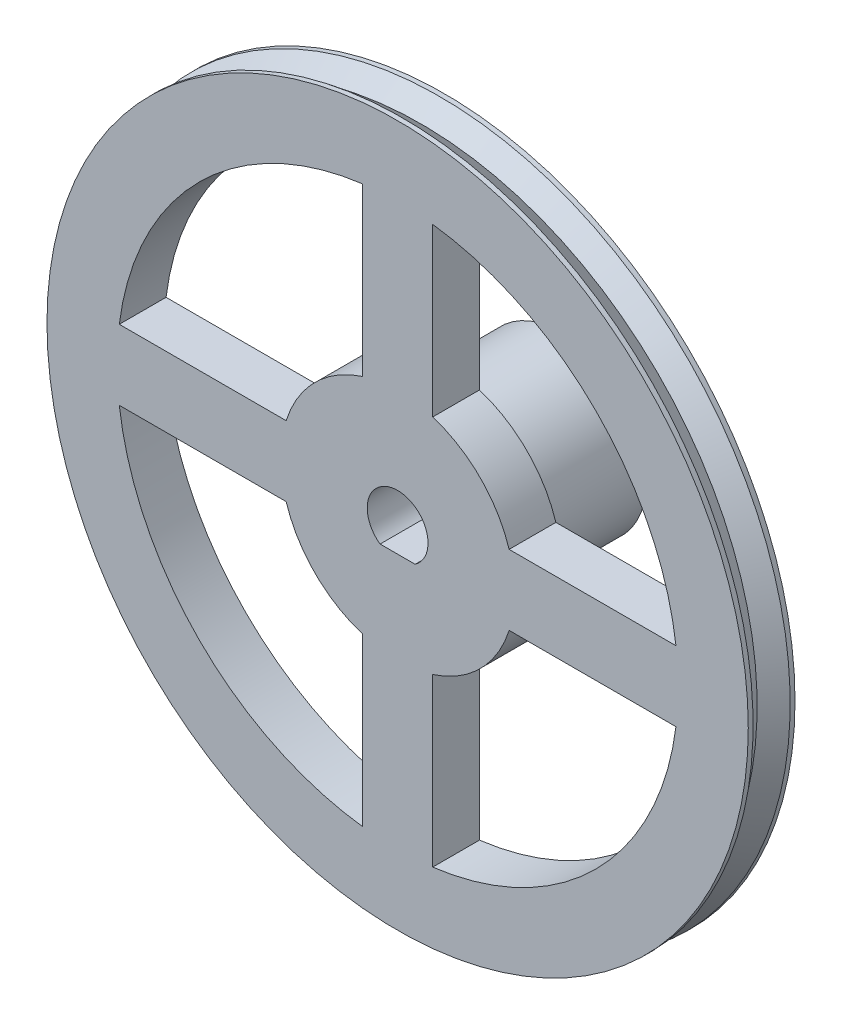
ISO-10303-21;
HEADER;
FILE_DESCRIPTION(('STEP AP214'),'2;1');
FILE_NAME('part.step','',(''),(''),'','','');
FILE_SCHEMA(('AUTOMOTIVE_DESIGN { 1 0 10303 214 1 1 1 1 }'));
ENDSEC;
DATA;
#1=APPLICATION_CONTEXT('core data for automotive mechanical design processes');
#2=APPLICATION_PROTOCOL_DEFINITION('international standard','automotive_design',2000,#1);
#3=PRODUCT_CONTEXT('',#1,'mechanical');
#4=PRODUCT('Part','Part','',(#3));
#5=PRODUCT_RELATED_PRODUCT_CATEGORY('part','',(#4));
#6=PRODUCT_DEFINITION_FORMATION('','',#4);
#7=PRODUCT_DEFINITION_CONTEXT('part definition',#1,'design');
#8=PRODUCT_DEFINITION('design','',#6,#7);
#9=PRODUCT_DEFINITION_SHAPE('','',#8);
#10=(LENGTH_UNIT() NAMED_UNIT(*) SI_UNIT(.MILLI.,.METRE.));
#11=(NAMED_UNIT(*) PLANE_ANGLE_UNIT() SI_UNIT($,.RADIAN.));
#12=(NAMED_UNIT(*) SI_UNIT($,.STERADIAN.) SOLID_ANGLE_UNIT());
#13=UNCERTAINTY_MEASURE_WITH_UNIT(LENGTH_MEASURE(1.E-05),#10,'distance_accuracy_value','');
#14=(GEOMETRIC_REPRESENTATION_CONTEXT(3) GLOBAL_UNCERTAINTY_ASSIGNED_CONTEXT((#13)) GLOBAL_UNIT_ASSIGNED_CONTEXT((#10,
#11,#12)) REPRESENTATION_CONTEXT('',''));
#15=CARTESIAN_POINT('',(0.,0.,0.));
#16=DIRECTION('',(0.,0.,1.));
#17=DIRECTION('',(1.,0.,0.));
#18=AXIS2_PLACEMENT_3D('',#15,#16,#17);
#19=CARTESIAN_POINT('',(0.,0.,4.));
#20=DIRECTION('',(0.,0.,1.));
#21=DIRECTION('',(1.,0.,0.));
#22=AXIS2_PLACEMENT_3D('',#19,#20,#21);
#23=PLANE('',#22);
#24=CARTESIAN_POINT('',(0.,0.,4.));
#25=DIRECTION('',(0.,0.,1.));
#26=DIRECTION('',(1.,0.,0.));
#27=AXIS2_PLACEMENT_3D('',#24,#25,#26);
#28=CIRCLE('',#27,24.);
#29=CARTESIAN_POINT('',(23.8117617995813,2.99999999999999,4.));
#30=VERTEX_POINT('',#29);
#31=CARTESIAN_POINT('',(3.,23.8117617995813,4.));
#32=VERTEX_POINT('',#31);
#33=EDGE_CURVE('E11',#30,#32,#28,.T.);
#34=ORIENTED_EDGE('',*,*,#33,.F.);
#35=DIRECTION('',(1.,0.,0.));
#36=VECTOR('',#35,1.);
#37=CARTESIAN_POINT('',(0.,3.,4.));
#38=LINE('',#37,#36);
#39=CARTESIAN_POINT('',(9.53939201416946,3.,4.));
#40=VERTEX_POINT('',#39);
#41=EDGE_CURVE('E300',#40,#30,#38,.T.);
#42=ORIENTED_EDGE('',*,*,#41,.F.);
#43=CARTESIAN_POINT('',(0.,0.,4.));
#44=DIRECTION('',(0.,0.,1.));
#45=DIRECTION('',(1.,0.,0.));
#46=AXIS2_PLACEMENT_3D('',#43,#44,#45);
#47=CIRCLE('',#46,10.);
#48=CARTESIAN_POINT('',(3.,9.53939201416946,4.));
#49=VERTEX_POINT('',#48);
#50=EDGE_CURVE('E302',#49,#40,#47,.F.);
#51=ORIENTED_EDGE('',*,*,#50,.F.);
#52=DIRECTION('',(0.,-1.,0.));
#53=VECTOR('',#52,1.);
#54=CARTESIAN_POINT('',(3.,0.,4.));
#55=LINE('',#54,#53);
#56=EDGE_CURVE('E41',#32,#49,#55,.T.);
#57=ORIENTED_EDGE('',*,*,#56,.F.);
#58=EDGE_LOOP('',(#34,#42,#51,#57));
#59=FACE_BOUND('',#58,.T.);
#60=CARTESIAN_POINT('',(0.,0.,4.));
#61=DIRECTION('',(0.,0.,1.));
#62=DIRECTION('',(1.,0.,0.));
#63=AXIS2_PLACEMENT_3D('',#60,#61,#62);
#64=CIRCLE('',#63,24.);
#65=CARTESIAN_POINT('',(-2.99999999999999,23.8117617995813,4.));
#66=VERTEX_POINT('',#65);
#67=CARTESIAN_POINT('',(-23.8117617995813,3.,4.));
#68=VERTEX_POINT('',#67);
#69=EDGE_CURVE('E298',#66,#68,#64,.T.);
#70=ORIENTED_EDGE('',*,*,#69,.F.);
#71=DIRECTION('',(0.,1.,0.));
#72=VECTOR('',#71,1.);
#73=CARTESIAN_POINT('',(-3.,0.,4.));
#74=LINE('',#73,#72);
#75=CARTESIAN_POINT('',(-3.,9.53939201416946,4.));
#76=VERTEX_POINT('',#75);
#77=EDGE_CURVE('E291',#76,#66,#74,.T.);
#78=ORIENTED_EDGE('',*,*,#77,.F.);
#79=CARTESIAN_POINT('',(0.,0.,4.));
#80=DIRECTION('',(0.,0.,1.));
#81=DIRECTION('',(1.,0.,0.));
#82=AXIS2_PLACEMENT_3D('',#79,#80,#81);
#83=CIRCLE('',#82,10.);
#84=CARTESIAN_POINT('',(-9.53939201416946,3.,4.));
#85=VERTEX_POINT('',#84);
#86=EDGE_CURVE('E293',#85,#76,#83,.F.);
#87=ORIENTED_EDGE('',*,*,#86,.F.);
#88=DIRECTION('',(1.,0.,0.));
#89=VECTOR('',#88,1.);
#90=CARTESIAN_POINT('',(0.,3.,4.));
#91=LINE('',#90,#89);
#92=EDGE_CURVE('E296',#68,#85,#91,.T.);
#93=ORIENTED_EDGE('',*,*,#92,.F.);
#94=EDGE_LOOP('',(#70,#78,#87,#93));
#95=FACE_BOUND('',#94,.T.);
#96=CARTESIAN_POINT('',(0.,0.,4.));
#97=DIRECTION('',(0.,0.,1.));
#98=DIRECTION('',(1.,0.,0.));
#99=AXIS2_PLACEMENT_3D('',#96,#97,#98);
#100=CIRCLE('',#99,24.);
#101=CARTESIAN_POINT('',(-23.8117617995813,-2.99999999999999,4.));
#102=VERTEX_POINT('',#101);
#103=CARTESIAN_POINT('',(-3.,-23.8117617995813,4.));
#104=VERTEX_POINT('',#103);
#105=EDGE_CURVE('E289',#102,#104,#100,.T.);
#106=ORIENTED_EDGE('',*,*,#105,.F.);
#107=DIRECTION('',(-1.,0.,0.));
#108=VECTOR('',#107,1.);
#109=CARTESIAN_POINT('',(0.,-3.,4.));
#110=LINE('',#109,#108);
#111=CARTESIAN_POINT('',(-9.53939201416945,-3.,4.));
#112=VERTEX_POINT('',#111);
#113=EDGE_CURVE('E282',#112,#102,#110,.T.);
#114=ORIENTED_EDGE('',*,*,#113,.F.);
#115=CARTESIAN_POINT('',(0.,0.,4.));
#116=DIRECTION('',(0.,0.,1.));
#117=DIRECTION('',(1.,0.,0.));
#118=AXIS2_PLACEMENT_3D('',#115,#116,#117);
#119=CIRCLE('',#118,10.);
#120=CARTESIAN_POINT('',(-3.,-9.53939201416946,4.));
#121=VERTEX_POINT('',#120);
#122=EDGE_CURVE('E284',#121,#112,#119,.F.);
#123=ORIENTED_EDGE('',*,*,#122,.F.);
#124=DIRECTION('',(0.,1.,0.));
#125=VECTOR('',#124,1.);
#126=CARTESIAN_POINT('',(-3.,0.,4.));
#127=LINE('',#126,#125);
#128=EDGE_CURVE('E287',#104,#121,#127,.T.);
#129=ORIENTED_EDGE('',*,*,#128,.F.);
#130=EDGE_LOOP('',(#106,#114,#123,#129));
#131=FACE_BOUND('',#130,.T.);
#132=CARTESIAN_POINT('',(0.,0.,4.));
#133=DIRECTION('',(0.,0.,1.));
#134=DIRECTION('',(1.,0.,0.));
#135=AXIS2_PLACEMENT_3D('',#132,#133,#134);
#136=CIRCLE('',#135,24.);
#137=CARTESIAN_POINT('',(2.99999999999999,-23.8117617995813,4.));
#138=VERTEX_POINT('',#137);
#139=CARTESIAN_POINT('',(23.8117617995813,-3.,4.));
#140=VERTEX_POINT('',#139);
#141=EDGE_CURVE('E280',#138,#140,#136,.T.);
#142=ORIENTED_EDGE('',*,*,#141,.F.);
#143=DIRECTION('',(0.,-1.,0.));
#144=VECTOR('',#143,1.);
#145=CARTESIAN_POINT('',(3.,0.,4.));
#146=LINE('',#145,#144);
#147=CARTESIAN_POINT('',(3.,-9.53939201416946,4.));
#148=VERTEX_POINT('',#147);
#149=EDGE_CURVE('E273',#148,#138,#146,.T.);
#150=ORIENTED_EDGE('',*,*,#149,.F.);
#151=CARTESIAN_POINT('',(0.,0.,4.));
#152=DIRECTION('',(0.,0.,1.));
#153=DIRECTION('',(1.,0.,0.));
#154=AXIS2_PLACEMENT_3D('',#151,#152,#153);
#155=CIRCLE('',#154,10.);
#156=CARTESIAN_POINT('',(9.53939201416946,-3.,4.));
#157=VERTEX_POINT('',#156);
#158=EDGE_CURVE('E275',#157,#148,#155,.F.);
#159=ORIENTED_EDGE('',*,*,#158,.F.);
#160=DIRECTION('',(-1.,0.,0.));
#161=VECTOR('',#160,1.);
#162=CARTESIAN_POINT('',(0.,-3.,4.));
#163=LINE('',#162,#161);
#164=EDGE_CURVE('E278',#140,#157,#163,.T.);
#165=ORIENTED_EDGE('',*,*,#164,.F.);
#166=EDGE_LOOP('',(#142,#150,#159,#165));
#167=FACE_BOUND('',#166,.T.);
#168=CARTESIAN_POINT('',(0.,0.,4.));
#169=DIRECTION('',(0.,0.,1.));
#170=DIRECTION('',(1.,0.,0.));
#171=AXIS2_PLACEMENT_3D('',#168,#169,#170);
#172=CIRCLE('',#171,30.);
#173=CARTESIAN_POINT('',(30.,0.,4.));
#174=VERTEX_POINT('',#173);
#175=EDGE_CURVE('E265',#174,#174,#172,.T.);
#176=ORIENTED_EDGE('',*,*,#175,.T.);
#177=EDGE_LOOP('',(#176));
#178=FACE_BOUND('',#177,.T.);
#179=DIRECTION('',(1.,0.,0.));
#180=VECTOR('',#179,1.);
#181=CARTESIAN_POINT('',(-1.5,-2.12367605815953,4.));
#182=LINE('',#181,#180);
#183=CARTESIAN_POINT('',(-1.5,-2.12367605815953,4.));
#184=VERTEX_POINT('',#183);
#185=CARTESIAN_POINT('',(1.5,-2.12367605815953,4.));
#186=VERTEX_POINT('',#185);
#187=EDGE_CURVE('E156',#184,#186,#182,.T.);
#188=ORIENTED_EDGE('',*,*,#187,.F.);
#189=CARTESIAN_POINT('',(0.,0.,4.));
#190=DIRECTION('',(0.,0.,1.));
#191=DIRECTION('',(1.,0.,0.));
#192=AXIS2_PLACEMENT_3D('',#189,#190,#191);
#193=CIRCLE('',#192,2.6);
#194=EDGE_CURVE('E162',#186,#184,#193,.T.);
#195=ORIENTED_EDGE('',*,*,#194,.F.);
#196=EDGE_LOOP('',(#188,#195));
#197=FACE_BOUND('',#196,.T.);
#198=ADVANCED_FACE('F33',(#59,#95,#131,#167,#178,#197),#23,.T.);
#199=CARTESIAN_POINT('',(0.,0.,-10.));
#200=DIRECTION('',(0.,0.,-1.));
#201=DIRECTION('',(-1.,0.,0.));
#202=AXIS2_PLACEMENT_3D('',#199,#200,#201);
#203=PLANE('',#202);
#204=CARTESIAN_POINT('',(0.,0.,-10.));
#205=DIRECTION('',(0.,0.,-1.));
#206=DIRECTION('',(-1.,0.,0.));
#207=AXIS2_PLACEMENT_3D('',#204,#205,#206);
#208=CIRCLE('',#207,7.31939161260648);
#209=CARTESIAN_POINT('',(-7.31939161260648,0.,-10.));
#210=VERTEX_POINT('',#209);
#211=EDGE_CURVE('E246',#210,#210,#208,.T.);
#212=ORIENTED_EDGE('',*,*,#211,.T.);
#213=EDGE_LOOP('',(#212));
#214=FACE_BOUND('',#213,.T.);
#215=DIRECTION('',(1.,0.,0.));
#216=VECTOR('',#215,1.);
#217=CARTESIAN_POINT('',(-1.5,-2.12367605815953,-10.));
#218=LINE('',#217,#216);
#219=CARTESIAN_POINT('',(-1.5,-2.12367605815953,-10.));
#220=VERTEX_POINT('',#219);
#221=CARTESIAN_POINT('',(1.5,-2.12367605815953,-10.));
#222=VERTEX_POINT('',#221);
#223=EDGE_CURVE('E166',#220,#222,#218,.T.);
#224=ORIENTED_EDGE('',*,*,#223,.T.);
#225=CARTESIAN_POINT('',(0.,0.,-10.));
#226=DIRECTION('',(0.,0.,1.));
#227=DIRECTION('',(1.,0.,0.));
#228=AXIS2_PLACEMENT_3D('',#225,#226,#227);
#229=CIRCLE('',#228,2.6);
#230=EDGE_CURVE('E55',#222,#220,#229,.T.);
#231=ORIENTED_EDGE('',*,*,#230,.T.);
#232=EDGE_LOOP('',(#224,#231));
#233=FACE_BOUND('',#232,.T.);
#234=ADVANCED_FACE('F348',(#214,#233),#203,.T.);
#235=CARTESIAN_POINT('',(0.,0.,4.));
#236=DIRECTION('',(0.,0.,-1.));
#237=DIRECTION('',(-1.,0.,0.));
#238=AXIS2_PLACEMENT_3D('',#235,#236,#237);
#239=CYLINDRICAL_SURFACE('',#238,30.);
#240=CARTESIAN_POINT('',(0.,0.,0.412864804198736));
#241=DIRECTION('',(0.,0.,-1.));
#242=DIRECTION('',(-1.,0.,0.));
#243=AXIS2_PLACEMENT_3D('',#240,#241,#242);
#244=CIRCLE('',#243,30.);
#245=CARTESIAN_POINT('',(-30.,0.,0.412864804198736));
#246=VERTEX_POINT('',#245);
#247=EDGE_CURVE('E261',#246,#246,#244,.T.);
#248=ORIENTED_EDGE('',*,*,#247,.T.);
#249=EDGE_LOOP('',(#248));
#250=FACE_BOUND('',#249,.T.);
#251=CARTESIAN_POINT('',(0.,0.,0.));
#252=DIRECTION('',(0.,0.,1.));
#253=DIRECTION('',(1.,0.,0.));
#254=AXIS2_PLACEMENT_3D('',#251,#252,#253);
#255=CIRCLE('',#254,30.);
#256=CARTESIAN_POINT('',(30.,0.,0.));
#257=VERTEX_POINT('',#256);
#258=EDGE_CURVE('E264',#257,#257,#255,.T.);
#259=ORIENTED_EDGE('',*,*,#258,.T.);
#260=EDGE_LOOP('',(#259));
#261=FACE_BOUND('',#260,.T.);
#262=ADVANCED_FACE('F330',(#250,#261),#239,.T.);
#263=CARTESIAN_POINT('',(0.,0.,0.));
#264=DIRECTION('',(0.,0.,1.));
#265=DIRECTION('',(1.,0.,0.));
#266=AXIS2_PLACEMENT_3D('',#263,#264,#265);
#267=PLANE('',#266);
#268=DIRECTION('',(-1.,0.,0.));
#269=VECTOR('',#268,1.);
#270=CARTESIAN_POINT('',(23.8117617995813,2.99999999999999,0.));
#271=LINE('',#270,#269);
#272=CARTESIAN_POINT('',(23.8117617995813,2.99999999999999,0.));
#273=VERTEX_POINT('',#272);
#274=CARTESIAN_POINT('',(9.53939201416946,3.,0.));
#275=VERTEX_POINT('',#274);
#276=EDGE_CURVE('E175',#273,#275,#271,.T.);
#277=ORIENTED_EDGE('',*,*,#276,.F.);
#278=CARTESIAN_POINT('',(0.,0.,0.));
#279=DIRECTION('',(0.,0.,-1.));
#280=DIRECTION('',(-1.,0.,0.));
#281=AXIS2_PLACEMENT_3D('',#278,#279,#280);
#282=CIRCLE('',#281,24.);
#283=CARTESIAN_POINT('',(3.,23.8117617995813,0.));
#284=VERTEX_POINT('',#283);
#285=EDGE_CURVE('E173',#284,#273,#282,.T.);
#286=ORIENTED_EDGE('',*,*,#285,.F.);
#287=DIRECTION('',(0.,1.,0.));
#288=VECTOR('',#287,1.);
#289=CARTESIAN_POINT('',(3.,23.8117617995813,0.));
#290=LINE('',#289,#288);
#291=CARTESIAN_POINT('',(3.,9.53939201416946,0.));
#292=VERTEX_POINT('',#291);
#293=EDGE_CURVE('E182',#292,#284,#290,.T.);
#294=ORIENTED_EDGE('',*,*,#293,.F.);
#295=CARTESIAN_POINT('',(0.,0.,0.));
#296=DIRECTION('',(0.,0.,1.));
#297=DIRECTION('',(-1.,0.,0.));
#298=AXIS2_PLACEMENT_3D('',#295,#296,#297);
#299=CIRCLE('',#298,10.);
#300=EDGE_CURVE('E179',#275,#292,#299,.T.);
#301=ORIENTED_EDGE('',*,*,#300,.F.);
#302=EDGE_LOOP('',(#277,#286,#294,#301));
#303=FACE_BOUND('',#302,.T.);
#304=DIRECTION('',(0.,-1.,0.));
#305=VECTOR('',#304,1.);
#306=CARTESIAN_POINT('',(-2.99999999999999,23.8117617995813,0.));
#307=LINE('',#306,#305);
#308=CARTESIAN_POINT('',(-2.99999999999999,23.8117617995813,0.));
#309=VERTEX_POINT('',#308);
#310=CARTESIAN_POINT('',(-3.,9.53939201416946,0.));
#311=VERTEX_POINT('',#310);
#312=EDGE_CURVE('E197',#309,#311,#307,.T.);
#313=ORIENTED_EDGE('',*,*,#312,.F.);
#314=CARTESIAN_POINT('',(0.,0.,0.));
#315=DIRECTION('',(0.,0.,-1.));
#316=DIRECTION('',(-1.,0.,0.));
#317=AXIS2_PLACEMENT_3D('',#314,#315,#316);
#318=CIRCLE('',#317,24.);
#319=CARTESIAN_POINT('',(-23.8117617995813,3.,0.));
#320=VERTEX_POINT('',#319);
#321=EDGE_CURVE('E195',#320,#309,#318,.T.);
#322=ORIENTED_EDGE('',*,*,#321,.F.);
#323=DIRECTION('',(-1.,0.,0.));
#324=VECTOR('',#323,1.);
#325=CARTESIAN_POINT('',(-23.8117617995813,3.,0.));
#326=LINE('',#325,#324);
#327=CARTESIAN_POINT('',(-9.53939201416946,3.,0.));
#328=VERTEX_POINT('',#327);
#329=EDGE_CURVE('E204',#328,#320,#326,.T.);
#330=ORIENTED_EDGE('',*,*,#329,.F.);
#331=CARTESIAN_POINT('',(0.,0.,0.));
#332=DIRECTION('',(0.,0.,1.));
#333=DIRECTION('',(-1.,0.,0.));
#334=AXIS2_PLACEMENT_3D('',#331,#332,#333);
#335=CIRCLE('',#334,10.);
#336=EDGE_CURVE('E201',#311,#328,#335,.T.);
#337=ORIENTED_EDGE('',*,*,#336,.F.);
#338=EDGE_LOOP('',(#313,#322,#330,#337));
#339=FACE_BOUND('',#338,.T.);
#340=DIRECTION('',(1.,0.,0.));
#341=VECTOR('',#340,1.);
#342=CARTESIAN_POINT('',(-23.8117617995813,-2.99999999999999,0.));
#343=LINE('',#342,#341);
#344=CARTESIAN_POINT('',(-23.8117617995813,-2.99999999999999,0.));
#345=VERTEX_POINT('',#344);
#346=CARTESIAN_POINT('',(-9.53939201416945,-3.,0.));
#347=VERTEX_POINT('',#346);
#348=EDGE_CURVE('E216',#345,#347,#343,.T.);
#349=ORIENTED_EDGE('',*,*,#348,.F.);
#350=CARTESIAN_POINT('',(0.,0.,0.));
#351=DIRECTION('',(0.,0.,-1.));
#352=DIRECTION('',(-1.,0.,0.));
#353=AXIS2_PLACEMENT_3D('',#350,#351,#352);
#354=CIRCLE('',#353,24.);
#355=CARTESIAN_POINT('',(-3.,-23.8117617995813,0.));
#356=VERTEX_POINT('',#355);
#357=EDGE_CURVE('E172',#356,#345,#354,.T.);
#358=ORIENTED_EDGE('',*,*,#357,.F.);
#359=DIRECTION('',(0.,-1.,0.));
#360=VECTOR('',#359,1.);
#361=CARTESIAN_POINT('',(-3.,-23.8117617995813,0.));
#362=LINE('',#361,#360);
#363=CARTESIAN_POINT('',(-3.,-9.53939201416946,0.));
#364=VERTEX_POINT('',#363);
#365=EDGE_CURVE('E222',#364,#356,#362,.T.);
#366=ORIENTED_EDGE('',*,*,#365,.F.);
#367=CARTESIAN_POINT('',(0.,0.,0.));
#368=DIRECTION('',(0.,0.,1.));
#369=DIRECTION('',(-1.,0.,0.));
#370=AXIS2_PLACEMENT_3D('',#367,#368,#369);
#371=CIRCLE('',#370,10.);
#372=EDGE_CURVE('E219',#347,#364,#371,.T.);
#373=ORIENTED_EDGE('',*,*,#372,.F.);
#374=EDGE_LOOP('',(#349,#358,#366,#373));
#375=FACE_BOUND('',#374,.T.);
#376=DIRECTION('',(0.,1.,0.));
#377=VECTOR('',#376,1.);
#378=CARTESIAN_POINT('',(2.99999999999999,-23.8117617995813,0.));
#379=LINE('',#378,#377);
#380=CARTESIAN_POINT('',(2.99999999999999,-23.8117617995813,0.));
#381=VERTEX_POINT('',#380);
#382=CARTESIAN_POINT('',(3.,-9.53939201416946,0.));
#383=VERTEX_POINT('',#382);
#384=EDGE_CURVE('E234',#381,#383,#379,.T.);
#385=ORIENTED_EDGE('',*,*,#384,.F.);
#386=CARTESIAN_POINT('',(0.,0.,0.));
#387=DIRECTION('',(0.,0.,-1.));
#388=DIRECTION('',(-1.,0.,0.));
#389=AXIS2_PLACEMENT_3D('',#386,#387,#388);
#390=CIRCLE('',#389,24.);
#391=CARTESIAN_POINT('',(23.8117617995813,-3.,0.));
#392=VERTEX_POINT('',#391);
#393=EDGE_CURVE('E188',#392,#381,#390,.T.);
#394=ORIENTED_EDGE('',*,*,#393,.F.);
#395=DIRECTION('',(1.,0.,0.));
#396=VECTOR('',#395,1.);
#397=CARTESIAN_POINT('',(23.8117617995813,-3.,0.));
#398=LINE('',#397,#396);
#399=CARTESIAN_POINT('',(9.53939201416946,-3.,0.));
#400=VERTEX_POINT('',#399);
#401=EDGE_CURVE('E240',#400,#392,#398,.T.);
#402=ORIENTED_EDGE('',*,*,#401,.F.);
#403=CARTESIAN_POINT('',(0.,0.,0.));
#404=DIRECTION('',(0.,0.,1.));
#405=DIRECTION('',(-1.,0.,0.));
#406=AXIS2_PLACEMENT_3D('',#403,#404,#405);
#407=CIRCLE('',#406,10.);
#408=EDGE_CURVE('E237',#383,#400,#407,.T.);
#409=ORIENTED_EDGE('',*,*,#408,.F.);
#410=EDGE_LOOP('',(#385,#394,#402,#409));
#411=FACE_BOUND('',#410,.T.);
#412=CARTESIAN_POINT('',(0.,0.,0.));
#413=DIRECTION('',(0.,0.,1.));
#414=DIRECTION('',(1.,0.,0.));
#415=AXIS2_PLACEMENT_3D('',#412,#413,#414);
#416=CIRCLE('',#415,7.31939161260648);
#417=CARTESIAN_POINT('',(7.31939161260648,0.,0.));
#418=VERTEX_POINT('',#417);
#419=EDGE_CURVE('E268',#418,#418,#416,.F.);
#420=ORIENTED_EDGE('',*,*,#419,.F.);
#421=EDGE_LOOP('',(#420));
#422=FACE_BOUND('',#421,.T.);
#423=ORIENTED_EDGE('',*,*,#258,.F.);
#424=EDGE_LOOP('',(#423));
#425=FACE_BOUND('',#424,.T.);
#426=ADVANCED_FACE('F326',(#303,#339,#375,#411,#422,#425),#267,.F.);
#427=CARTESIAN_POINT('',(0.,0.,2.));
#428=DIRECTION('',(0.,0.,-1.));
#429=DIRECTION('',(-1.,0.,0.));
#430=AXIS2_PLACEMENT_3D('',#427,#428,#429);
#431=CONICAL_SURFACE('',#430,28.7590481663279,0.663595095734422);
#432=ORIENTED_EDGE('',*,*,#247,.F.);
#433=EDGE_LOOP('',(#432));
#434=FACE_BOUND('',#433,.T.);
#435=CARTESIAN_POINT('',(0.,0.,2.));
#436=DIRECTION('',(0.,0.,-1.));
#437=DIRECTION('',(-1.,0.,0.));
#438=AXIS2_PLACEMENT_3D('',#435,#436,#437);
#439=CIRCLE('',#438,28.7590481663279);
#440=CARTESIAN_POINT('',(-28.7590481663279,0.,2.));
#441=VERTEX_POINT('',#440);
#442=EDGE_CURVE('E258',#441,#441,#439,.T.);
#443=ORIENTED_EDGE('',*,*,#442,.T.);
#444=EDGE_LOOP('',(#443));
#445=FACE_BOUND('',#444,.T.);
#446=ADVANCED_FACE('F329',(#434,#445),#431,.T.);
#447=CARTESIAN_POINT('',(0.,0.,3.58713519580126));
#448=DIRECTION('',(0.,0.,1.));
#449=DIRECTION('',(1.,0.,0.));
#450=AXIS2_PLACEMENT_3D('',#447,#448,#449);
#451=CONICAL_SURFACE('',#450,30.,0.663595095734422);
#452=ORIENTED_EDGE('',*,*,#442,.F.);
#453=EDGE_LOOP('',(#452));
#454=FACE_BOUND('',#453,.T.);
#455=CARTESIAN_POINT('',(0.,0.,3.58713519580126));
#456=DIRECTION('',(0.,0.,-1.));
#457=DIRECTION('',(-1.,0.,0.));
#458=AXIS2_PLACEMENT_3D('',#455,#456,#457);
#459=CIRCLE('',#458,30.);
#460=CARTESIAN_POINT('',(-30.,0.,3.58713519580126));
#461=VERTEX_POINT('',#460);
#462=EDGE_CURVE('E255',#461,#461,#459,.T.);
#463=ORIENTED_EDGE('',*,*,#462,.T.);
#464=EDGE_LOOP('',(#463));
#465=FACE_BOUND('',#464,.T.);
#466=ADVANCED_FACE('F357',(#454,#465),#451,.T.);
#467=ORIENTED_EDGE('',*,*,#462,.F.);
#468=EDGE_LOOP('',(#467));
#469=FACE_BOUND('',#468,.T.);
#470=ORIENTED_EDGE('',*,*,#175,.F.);
#471=EDGE_LOOP('',(#470));
#472=FACE_BOUND('',#471,.T.);
#473=ADVANCED_FACE('F35',(#469,#472),#239,.T.);
#474=CARTESIAN_POINT('',(0.,0.,-10.));
#475=DIRECTION('',(0.,0.,1.));
#476=DIRECTION('',(1.,0.,0.));
#477=AXIS2_PLACEMENT_3D('',#474,#475,#476);
#478=CYLINDRICAL_SURFACE('',#477,7.31939161260648);
#479=ORIENTED_EDGE('',*,*,#211,.F.);
#480=EDGE_LOOP('',(#479));
#481=FACE_BOUND('',#480,.T.);
#482=ORIENTED_EDGE('',*,*,#419,.T.);
#483=EDGE_LOOP('',(#482));
#484=FACE_BOUND('',#483,.T.);
#485=ADVANCED_FACE('F356',(#481,#484),#478,.T.);
#486=CARTESIAN_POINT('',(0.,0.,10.));
#487=DIRECTION('',(0.,0.,-1.));
#488=DIRECTION('',(-1.,0.,0.));
#489=AXIS2_PLACEMENT_3D('',#486,#487,#488);
#490=CYLINDRICAL_SURFACE('',#489,24.);
#491=ORIENTED_EDGE('',*,*,#141,.T.);
#492=DIRECTION('',(0.,0.,-1.));
#493=VECTOR('',#492,1.);
#494=CARTESIAN_POINT('',(23.8117617995813,-3.,10.));
#495=LINE('',#494,#493);
#496=EDGE_CURVE('E244',#140,#392,#495,.T.);
#497=ORIENTED_EDGE('',*,*,#496,.T.);
#498=ORIENTED_EDGE('',*,*,#393,.T.);
#499=DIRECTION('',(0.,0.,-1.));
#500=VECTOR('',#499,1.);
#501=CARTESIAN_POINT('',(2.99999999999999,-23.8117617995813,10.));
#502=LINE('',#501,#500);
#503=EDGE_CURVE('E243',#138,#381,#502,.T.);
#504=ORIENTED_EDGE('',*,*,#503,.F.);
#505=EDGE_LOOP('',(#491,#497,#498,#504));
#506=FACE_BOUND('',#505,.T.);
#507=ADVANCED_FACE('F371',(#506),#490,.F.);
#508=CARTESIAN_POINT('',(23.8117617995813,-3.,10.));
#509=DIRECTION('',(0.,1.,0.));
#510=DIRECTION('',(0.,0.,1.));
#511=AXIS2_PLACEMENT_3D('',#508,#509,#510);
#512=PLANE('',#511);
#513=ORIENTED_EDGE('',*,*,#164,.T.);
#514=DIRECTION('',(0.,0.,-1.));
#515=VECTOR('',#514,1.);
#516=CARTESIAN_POINT('',(9.53939201416946,-3.,10.));
#517=LINE('',#516,#515);
#518=EDGE_CURVE('E247',#157,#400,#517,.T.);
#519=ORIENTED_EDGE('',*,*,#518,.T.);
#520=ORIENTED_EDGE('',*,*,#401,.T.);
#521=ORIENTED_EDGE('',*,*,#496,.F.);
#522=EDGE_LOOP('',(#513,#519,#520,#521));
#523=FACE_BOUND('',#522,.T.);
#524=ADVANCED_FACE('F376',(#523),#512,.F.);
#525=CARTESIAN_POINT('',(0.,0.,10.));
#526=DIRECTION('',(0.,0.,-1.));
#527=DIRECTION('',(-1.,0.,0.));
#528=AXIS2_PLACEMENT_3D('',#525,#526,#527);
#529=CYLINDRICAL_SURFACE('',#528,10.);
#530=ORIENTED_EDGE('',*,*,#158,.T.);
#531=DIRECTION('',(0.,0.,-1.));
#532=VECTOR('',#531,1.);
#533=CARTESIAN_POINT('',(3.,-9.53939201416946,10.));
#534=LINE('',#533,#532);
#535=EDGE_CURVE('E249',#148,#383,#534,.T.);
#536=ORIENTED_EDGE('',*,*,#535,.T.);
#537=ORIENTED_EDGE('',*,*,#408,.T.);
#538=ORIENTED_EDGE('',*,*,#518,.F.);
#539=EDGE_LOOP('',(#530,#536,#537,#538));
#540=FACE_BOUND('',#539,.T.);
#541=ADVANCED_FACE('F382',(#540),#529,.T.);
#542=CARTESIAN_POINT('',(2.99999999999999,-23.8117617995813,10.));
#543=DIRECTION('',(-1.,0.,0.));
#544=DIRECTION('',(0.,-1.,0.));
#545=AXIS2_PLACEMENT_3D('',#542,#543,#544);
#546=PLANE('',#545);
#547=ORIENTED_EDGE('',*,*,#149,.T.);
#548=ORIENTED_EDGE('',*,*,#503,.T.);
#549=ORIENTED_EDGE('',*,*,#384,.T.);
#550=ORIENTED_EDGE('',*,*,#535,.F.);
#551=EDGE_LOOP('',(#547,#548,#549,#550));
#552=FACE_BOUND('',#551,.T.);
#553=ADVANCED_FACE('F378',(#552),#546,.F.);
#554=CARTESIAN_POINT('',(0.,0.,10.));
#555=DIRECTION('',(0.,0.,-1.));
#556=DIRECTION('',(-1.,0.,0.));
#557=AXIS2_PLACEMENT_3D('',#554,#555,#556);
#558=CYLINDRICAL_SURFACE('',#557,24.);
#559=ORIENTED_EDGE('',*,*,#105,.T.);
#560=DIRECTION('',(0.,0.,-1.));
#561=VECTOR('',#560,1.);
#562=CARTESIAN_POINT('',(-3.,-23.8117617995813,10.));
#563=LINE('',#562,#561);
#564=EDGE_CURVE('E198',#104,#356,#563,.T.);
#565=ORIENTED_EDGE('',*,*,#564,.T.);
#566=ORIENTED_EDGE('',*,*,#357,.T.);
#567=DIRECTION('',(0.,0.,-1.));
#568=VECTOR('',#567,1.);
#569=CARTESIAN_POINT('',(-23.8117617995813,-2.99999999999999,10.));
#570=LINE('',#569,#568);
#571=EDGE_CURVE('E225',#102,#345,#570,.T.);
#572=ORIENTED_EDGE('',*,*,#571,.F.);
#573=EDGE_LOOP('',(#559,#565,#566,#572));
#574=FACE_BOUND('',#573,.T.);
#575=ADVANCED_FACE('F381',(#574),#558,.F.);
#576=CARTESIAN_POINT('',(-3.,-23.8117617995813,10.));
#577=DIRECTION('',(1.,0.,0.));
#578=DIRECTION('',(0.,1.,0.));
#579=AXIS2_PLACEMENT_3D('',#576,#577,#578);
#580=PLANE('',#579);
#581=ORIENTED_EDGE('',*,*,#128,.T.);
#582=DIRECTION('',(0.,0.,-1.));
#583=VECTOR('',#582,1.);
#584=CARTESIAN_POINT('',(-3.,-9.53939201416946,10.));
#585=LINE('',#584,#583);
#586=EDGE_CURVE('E227',#121,#364,#585,.T.);
#587=ORIENTED_EDGE('',*,*,#586,.T.);
#588=ORIENTED_EDGE('',*,*,#365,.T.);
#589=ORIENTED_EDGE('',*,*,#564,.F.);
#590=EDGE_LOOP('',(#581,#587,#588,#589));
#591=FACE_BOUND('',#590,.T.);
#592=ADVANCED_FACE('F392',(#591),#580,.F.);
#593=CARTESIAN_POINT('',(0.,0.,10.));
#594=DIRECTION('',(0.,0.,-1.));
#595=DIRECTION('',(-1.,0.,0.));
#596=AXIS2_PLACEMENT_3D('',#593,#594,#595);
#597=CYLINDRICAL_SURFACE('',#596,10.);
#598=ORIENTED_EDGE('',*,*,#122,.T.);
#599=DIRECTION('',(0.,0.,-1.));
#600=VECTOR('',#599,1.);
#601=CARTESIAN_POINT('',(-9.53939201416945,-3.,10.));
#602=LINE('',#601,#600);
#603=EDGE_CURVE('E229',#112,#347,#602,.T.);
#604=ORIENTED_EDGE('',*,*,#603,.T.);
#605=ORIENTED_EDGE('',*,*,#372,.T.);
#606=ORIENTED_EDGE('',*,*,#586,.F.);
#607=EDGE_LOOP('',(#598,#604,#605,#606));
#608=FACE_BOUND('',#607,.T.);
#609=ADVANCED_FACE('F398',(#608),#597,.T.);
#610=CARTESIAN_POINT('',(-23.8117617995813,-2.99999999999999,10.));
#611=DIRECTION('',(0.,1.,0.));
#612=DIRECTION('',(-1.,0.,0.));
#613=AXIS2_PLACEMENT_3D('',#610,#611,#612);
#614=PLANE('',#613);
#615=ORIENTED_EDGE('',*,*,#113,.T.);
#616=ORIENTED_EDGE('',*,*,#571,.T.);
#617=ORIENTED_EDGE('',*,*,#348,.T.);
#618=ORIENTED_EDGE('',*,*,#603,.F.);
#619=EDGE_LOOP('',(#615,#616,#617,#618));
#620=FACE_BOUND('',#619,.T.);
#621=ADVANCED_FACE('F394',(#620),#614,.F.);
#622=CARTESIAN_POINT('',(0.,0.,10.));
#623=DIRECTION('',(0.,0.,-1.));
#624=DIRECTION('',(-1.,0.,0.));
#625=AXIS2_PLACEMENT_3D('',#622,#623,#624);
#626=CYLINDRICAL_SURFACE('',#625,24.);
#627=ORIENTED_EDGE('',*,*,#69,.T.);
#628=DIRECTION('',(0.,0.,-1.));
#629=VECTOR('',#628,1.);
#630=CARTESIAN_POINT('',(-23.8117617995813,3.,10.));
#631=LINE('',#630,#629);
#632=EDGE_CURVE('E176',#68,#320,#631,.T.);
#633=ORIENTED_EDGE('',*,*,#632,.T.);
#634=ORIENTED_EDGE('',*,*,#321,.T.);
#635=DIRECTION('',(0.,0.,-1.));
#636=VECTOR('',#635,1.);
#637=CARTESIAN_POINT('',(-2.99999999999999,23.8117617995813,10.));
#638=LINE('',#637,#636);
#639=EDGE_CURVE('E207',#66,#309,#638,.T.);
#640=ORIENTED_EDGE('',*,*,#639,.F.);
#641=EDGE_LOOP('',(#627,#633,#634,#640));
#642=FACE_BOUND('',#641,.T.);
#643=ADVANCED_FACE('F397',(#642),#626,.F.);
#644=CARTESIAN_POINT('',(-23.8117617995813,3.,10.));
#645=DIRECTION('',(0.,-1.,0.));
#646=DIRECTION('',(1.,0.,0.));
#647=AXIS2_PLACEMENT_3D('',#644,#645,#646);
#648=PLANE('',#647);
#649=ORIENTED_EDGE('',*,*,#92,.T.);
#650=DIRECTION('',(0.,0.,-1.));
#651=VECTOR('',#650,1.);
#652=CARTESIAN_POINT('',(-9.53939201416946,3.,10.));
#653=LINE('',#652,#651);
#654=EDGE_CURVE('E209',#85,#328,#653,.T.);
#655=ORIENTED_EDGE('',*,*,#654,.T.);
#656=ORIENTED_EDGE('',*,*,#329,.T.);
#657=ORIENTED_EDGE('',*,*,#632,.F.);
#658=EDGE_LOOP('',(#649,#655,#656,#657));
#659=FACE_BOUND('',#658,.T.);
#660=ADVANCED_FACE('F408',(#659),#648,.F.);
#661=CARTESIAN_POINT('',(0.,0.,10.));
#662=DIRECTION('',(0.,0.,-1.));
#663=DIRECTION('',(-1.,0.,0.));
#664=AXIS2_PLACEMENT_3D('',#661,#662,#663);
#665=CYLINDRICAL_SURFACE('',#664,10.);
#666=ORIENTED_EDGE('',*,*,#86,.T.);
#667=DIRECTION('',(0.,0.,-1.));
#668=VECTOR('',#667,1.);
#669=CARTESIAN_POINT('',(-3.,9.53939201416946,10.));
#670=LINE('',#669,#668);
#671=EDGE_CURVE('E211',#76,#311,#670,.T.);
#672=ORIENTED_EDGE('',*,*,#671,.T.);
#673=ORIENTED_EDGE('',*,*,#336,.T.);
#674=ORIENTED_EDGE('',*,*,#654,.F.);
#675=EDGE_LOOP('',(#666,#672,#673,#674));
#676=FACE_BOUND('',#675,.T.);
#677=ADVANCED_FACE('F413',(#676),#665,.T.);
#678=CARTESIAN_POINT('',(-2.99999999999999,23.8117617995813,10.));
#679=DIRECTION('',(1.,0.,0.));
#680=DIRECTION('',(0.,1.,0.));
#681=AXIS2_PLACEMENT_3D('',#678,#679,#680);
#682=PLANE('',#681);
#683=ORIENTED_EDGE('',*,*,#77,.T.);
#684=ORIENTED_EDGE('',*,*,#639,.T.);
#685=ORIENTED_EDGE('',*,*,#312,.T.);
#686=ORIENTED_EDGE('',*,*,#671,.F.);
#687=EDGE_LOOP('',(#683,#684,#685,#686));
#688=FACE_BOUND('',#687,.T.);
#689=ADVANCED_FACE('F410',(#688),#682,.F.);
#690=CARTESIAN_POINT('',(0.,0.,10.));
#691=DIRECTION('',(0.,0.,-1.));
#692=DIRECTION('',(-1.,0.,0.));
#693=AXIS2_PLACEMENT_3D('',#690,#691,#692);
#694=CYLINDRICAL_SURFACE('',#693,24.);
#695=ORIENTED_EDGE('',*,*,#33,.T.);
#696=DIRECTION('',(0.,0.,-1.));
#697=VECTOR('',#696,1.);
#698=CARTESIAN_POINT('',(3.,23.8117617995813,10.));
#699=LINE('',#698,#697);
#700=EDGE_CURVE('E186',#32,#284,#699,.T.);
#701=ORIENTED_EDGE('',*,*,#700,.T.);
#702=ORIENTED_EDGE('',*,*,#285,.T.);
#703=DIRECTION('',(0.,0.,-1.));
#704=VECTOR('',#703,1.);
#705=CARTESIAN_POINT('',(23.8117617995813,2.99999999999999,10.));
#706=LINE('',#705,#704);
#707=EDGE_CURVE('E185',#30,#273,#706,.T.);
#708=ORIENTED_EDGE('',*,*,#707,.F.);
#709=EDGE_LOOP('',(#695,#701,#702,#708));
#710=FACE_BOUND('',#709,.T.);
#711=ADVANCED_FACE('F323',(#710),#694,.F.);
#712=CARTESIAN_POINT('',(3.,23.8117617995813,10.));
#713=DIRECTION('',(-1.,0.,0.));
#714=DIRECTION('',(0.,-1.,0.));
#715=AXIS2_PLACEMENT_3D('',#712,#713,#714);
#716=PLANE('',#715);
#717=ORIENTED_EDGE('',*,*,#56,.T.);
#718=DIRECTION('',(0.,0.,-1.));
#719=VECTOR('',#718,1.);
#720=CARTESIAN_POINT('',(3.,9.53939201416946,10.));
#721=LINE('',#720,#719);
#722=EDGE_CURVE('E189',#49,#292,#721,.T.);
#723=ORIENTED_EDGE('',*,*,#722,.T.);
#724=ORIENTED_EDGE('',*,*,#293,.T.);
#725=ORIENTED_EDGE('',*,*,#700,.F.);
#726=EDGE_LOOP('',(#717,#723,#724,#725));
#727=FACE_BOUND('',#726,.T.);
#728=ADVANCED_FACE('F308',(#727),#716,.F.);
#729=CARTESIAN_POINT('',(0.,0.,10.));
#730=DIRECTION('',(0.,0.,-1.));
#731=DIRECTION('',(-1.,0.,0.));
#732=AXIS2_PLACEMENT_3D('',#729,#730,#731);
#733=CYLINDRICAL_SURFACE('',#732,10.);
#734=ORIENTED_EDGE('',*,*,#50,.T.);
#735=DIRECTION('',(0.,0.,-1.));
#736=VECTOR('',#735,1.);
#737=CARTESIAN_POINT('',(9.53939201416946,3.,10.));
#738=LINE('',#737,#736);
#739=EDGE_CURVE('E191',#40,#275,#738,.T.);
#740=ORIENTED_EDGE('',*,*,#739,.T.);
#741=ORIENTED_EDGE('',*,*,#300,.T.);
#742=ORIENTED_EDGE('',*,*,#722,.F.);
#743=EDGE_LOOP('',(#734,#740,#741,#742));
#744=FACE_BOUND('',#743,.T.);
#745=ADVANCED_FACE('F313',(#744),#733,.T.);
#746=CARTESIAN_POINT('',(23.8117617995813,2.99999999999999,10.));
#747=DIRECTION('',(0.,-1.,0.));
#748=DIRECTION('',(1.,0.,0.));
#749=AXIS2_PLACEMENT_3D('',#746,#747,#748);
#750=PLANE('',#749);
#751=ORIENTED_EDGE('',*,*,#41,.T.);
#752=ORIENTED_EDGE('',*,*,#707,.T.);
#753=ORIENTED_EDGE('',*,*,#276,.T.);
#754=ORIENTED_EDGE('',*,*,#739,.F.);
#755=EDGE_LOOP('',(#751,#752,#753,#754));
#756=FACE_BOUND('',#755,.T.);
#757=ADVANCED_FACE('F320',(#756),#750,.F.);
#758=CARTESIAN_POINT('',(0.,0.,4.));
#759=DIRECTION('',(0.,0.,-1.));
#760=DIRECTION('',(-1.,0.,0.));
#761=AXIS2_PLACEMENT_3D('',#758,#759,#760);
#762=CYLINDRICAL_SURFACE('',#761,2.6);
#763=ORIENTED_EDGE('',*,*,#230,.F.);
#764=DIRECTION('',(0.,0.,-1.));
#765=VECTOR('',#764,1.);
#766=CARTESIAN_POINT('',(1.5,-2.12367605815953,4.));
#767=LINE('',#766,#765);
#768=EDGE_CURVE('E158',#186,#222,#767,.T.);
#769=ORIENTED_EDGE('',*,*,#768,.F.);
#770=ORIENTED_EDGE('',*,*,#194,.T.);
#771=DIRECTION('',(0.,0.,-1.));
#772=VECTOR('',#771,1.);
#773=CARTESIAN_POINT('',(-1.5,-2.12367605815953,4.));
#774=LINE('',#773,#772);
#775=EDGE_CURVE('E48',#184,#220,#774,.T.);
#776=ORIENTED_EDGE('',*,*,#775,.T.);
#777=EDGE_LOOP('',(#763,#769,#770,#776));
#778=FACE_BOUND('',#777,.T.);
#779=ADVANCED_FACE('F164',(#778),#762,.F.);
#780=CARTESIAN_POINT('',(-1.5,-2.12367605815953,4.));
#781=DIRECTION('',(0.,1.,0.));
#782=DIRECTION('',(0.,0.,1.));
#783=AXIS2_PLACEMENT_3D('',#780,#781,#782);
#784=PLANE('',#783);
#785=ORIENTED_EDGE('',*,*,#223,.F.);
#786=ORIENTED_EDGE('',*,*,#775,.F.);
#787=ORIENTED_EDGE('',*,*,#187,.T.);
#788=ORIENTED_EDGE('',*,*,#768,.T.);
#789=EDGE_LOOP('',(#785,#786,#787,#788));
#790=FACE_BOUND('',#789,.T.);
#791=ADVANCED_FACE('F157',(#790),#784,.T.);
#792=CLOSED_SHELL('',(#198,#234,#262,#426,#446,#466,#473,#485,#507,#524,#541,#553,#575,#592,
#609,#621,#643,#660,#677,#689,#711,#728,#745,#757,#779,#791));
#793=MANIFOLD_SOLID_BREP('B2',#792);
#794=ADVANCED_BREP_SHAPE_REPRESENTATION('',(#18,#793),#14);
#795=SHAPE_DEFINITION_REPRESENTATION(#9,#794);
ENDSEC;
END-ISO-10303-21;
